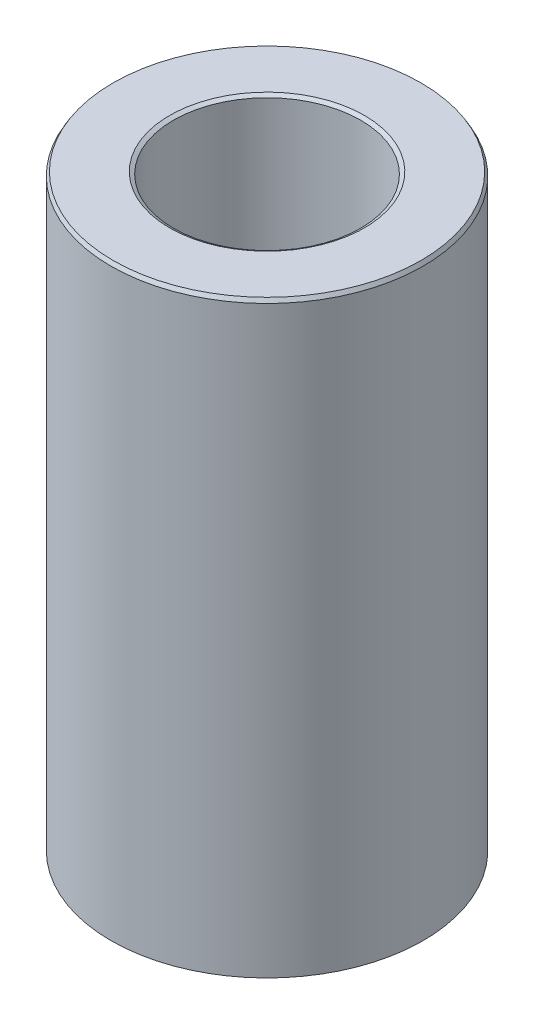
ISO-10303-21;
HEADER;
FILE_DESCRIPTION(('STEP AP214'),'2;1');
FILE_NAME('part.step','',(''),(''),'','','');
FILE_SCHEMA(('AUTOMOTIVE_DESIGN { 1 0 10303 214 1 1 1 1 }'));
ENDSEC;
DATA;
#1=APPLICATION_CONTEXT('core data for automotive mechanical design processes');
#2=APPLICATION_PROTOCOL_DEFINITION('international standard','automotive_design',2000,#1);
#3=PRODUCT_CONTEXT('',#1,'mechanical');
#4=PRODUCT('Part','Part','',(#3));
#5=PRODUCT_RELATED_PRODUCT_CATEGORY('part','',(#4));
#6=PRODUCT_DEFINITION_FORMATION('','',#4);
#7=PRODUCT_DEFINITION_CONTEXT('part definition',#1,'design');
#8=PRODUCT_DEFINITION('design','',#6,#7);
#9=PRODUCT_DEFINITION_SHAPE('','',#8);
#10=(LENGTH_UNIT() NAMED_UNIT(*) SI_UNIT(.MILLI.,.METRE.));
#11=(NAMED_UNIT(*) PLANE_ANGLE_UNIT() SI_UNIT($,.RADIAN.));
#12=(NAMED_UNIT(*) SI_UNIT($,.STERADIAN.) SOLID_ANGLE_UNIT());
#13=UNCERTAINTY_MEASURE_WITH_UNIT(LENGTH_MEASURE(1.E-05),#10,'distance_accuracy_value','');
#14=(GEOMETRIC_REPRESENTATION_CONTEXT(3) GLOBAL_UNCERTAINTY_ASSIGNED_CONTEXT((#13)) GLOBAL_UNIT_ASSIGNED_CONTEXT((#10,
#11,#12)) REPRESENTATION_CONTEXT('',''));
#15=CARTESIAN_POINT('',(0.,0.,0.));
#16=DIRECTION('',(0.,0.,1.));
#17=DIRECTION('',(1.,0.,0.));
#18=AXIS2_PLACEMENT_3D('',#15,#16,#17);
#19=CARTESIAN_POINT('',(0.,179.573982161007,0.));
#20=DIRECTION('',(0.,-1.,0.));
#21=DIRECTION('',(0.,0.,-1.));
#22=AXIS2_PLACEMENT_3D('',#19,#20,#21);
#23=CYLINDRICAL_SURFACE('',#22,47.5);
#24=CARTESIAN_POINT('',(0.,0.668235442624204,0.));
#25=DIRECTION('',(0.,1.,0.));
#26=DIRECTION('',(0.,0.,1.));
#27=AXIS2_PLACEMENT_3D('',#24,#25,#26);
#28=CIRCLE('',#27,47.5);
#29=CARTESIAN_POINT('',(0.,0.668235442624204,47.5));
#30=VERTEX_POINT('',#29);
#31=EDGE_CURVE('E10',#30,#30,#28,.T.);
#32=ORIENTED_EDGE('',*,*,#31,.T.);
#33=EDGE_LOOP('',(#32));
#34=FACE_BOUND('',#33,.T.);
#35=CARTESIAN_POINT('',(0.,178.416564422964,0.));
#36=DIRECTION('',(0.,1.,0.));
#37=DIRECTION('',(0.,0.,1.));
#38=AXIS2_PLACEMENT_3D('',#35,#36,#37);
#39=CIRCLE('',#38,47.5);
#40=CARTESIAN_POINT('',(0.,178.416564422964,47.5));
#41=VERTEX_POINT('',#40);
#42=EDGE_CURVE('E50',#41,#41,#39,.F.);
#43=ORIENTED_EDGE('',*,*,#42,.T.);
#44=EDGE_LOOP('',(#43));
#45=FACE_BOUND('',#44,.T.);
#46=ADVANCED_FACE('F39',(#34,#45),#23,.T.);
#47=CARTESIAN_POINT('',(0.,179.573982161007,0.));
#48=DIRECTION('',(0.,1.,0.));
#49=DIRECTION('',(0.,0.,1.));
#50=AXIS2_PLACEMENT_3D('',#47,#48,#49);
#51=PLANE('',#50);
#52=CARTESIAN_POINT('',(0.,179.573982161007,0.));
#53=DIRECTION('',(0.,1.,0.));
#54=DIRECTION('',(0.,0.,1.));
#55=AXIS2_PLACEMENT_3D('',#52,#53,#54);
#56=CIRCLE('',#55,29.6474263468338);
#57=CARTESIAN_POINT('',(0.,179.573982161007,29.6474263468338));
#58=VERTEX_POINT('',#57);
#59=EDGE_CURVE('E58',#58,#58,#56,.F.);
#60=ORIENTED_EDGE('',*,*,#59,.T.);
#61=EDGE_LOOP('',(#60));
#62=FACE_BOUND('',#61,.T.);
#63=CARTESIAN_POINT('',(0.,179.573982161007,0.));
#64=DIRECTION('',(0.,1.,0.));
#65=DIRECTION('',(0.,0.,1.));
#66=AXIS2_PLACEMENT_3D('',#63,#64,#65);
#67=CIRCLE('',#66,46.8317645573758);
#68=CARTESIAN_POINT('',(0.,179.573982161007,46.8317645573758));
#69=VERTEX_POINT('',#68);
#70=EDGE_CURVE('E61',#69,#69,#67,.T.);
#71=ORIENTED_EDGE('',*,*,#70,.T.);
#72=EDGE_LOOP('',(#71));
#73=FACE_BOUND('',#72,.T.);
#74=ADVANCED_FACE('F88',(#62,#73),#51,.T.);
#75=CARTESIAN_POINT('',(0.,0.,0.));
#76=DIRECTION('',(0.,1.,0.));
#77=DIRECTION('',(0.,0.,1.));
#78=AXIS2_PLACEMENT_3D('',#75,#76,#77);
#79=PLANE('',#78);
#80=CARTESIAN_POINT('',(0.,0.,0.));
#81=DIRECTION('',(0.,1.,0.));
#82=DIRECTION('',(0.,0.,1.));
#83=AXIS2_PLACEMENT_3D('',#80,#81,#82);
#84=CIRCLE('',#83,29.1582440514146);
#85=CARTESIAN_POINT('',(0.,0.,29.1582440514146));
#86=VERTEX_POINT('',#85);
#87=EDGE_CURVE('E51',#86,#86,#84,.T.);
#88=ORIENTED_EDGE('',*,*,#87,.T.);
#89=EDGE_LOOP('',(#88));
#90=FACE_BOUND('',#89,.T.);
#91=CARTESIAN_POINT('',(0.,0.,0.));
#92=DIRECTION('',(0.,1.,0.));
#93=DIRECTION('',(0.,0.,1.));
#94=AXIS2_PLACEMENT_3D('',#91,#92,#93);
#95=CIRCLE('',#94,46.3425822619566);
#96=CARTESIAN_POINT('',(0.,0.,46.3425822619566));
#97=VERTEX_POINT('',#96);
#98=EDGE_CURVE('E54',#97,#97,#95,.F.);
#99=ORIENTED_EDGE('',*,*,#98,.T.);
#100=EDGE_LOOP('',(#99));
#101=FACE_BOUND('',#100,.T.);
#102=ADVANCED_FACE('F83',(#90,#101),#79,.F.);
#103=CARTESIAN_POINT('',(0.,179.573982161007,0.));
#104=DIRECTION('',(0.,-1.,0.));
#105=DIRECTION('',(0.,0.,-1.));
#106=AXIS2_PLACEMENT_3D('',#103,#104,#105);
#107=CYLINDRICAL_SURFACE('',#106,28.4900086087904);
#108=CARTESIAN_POINT('',(0.,178.905746718383,0.));
#109=DIRECTION('',(0.,1.,0.));
#110=DIRECTION('',(0.,0.,1.));
#111=AXIS2_PLACEMENT_3D('',#108,#109,#110);
#112=CIRCLE('',#111,28.4900086087904);
#113=CARTESIAN_POINT('',(0.,178.905746718383,28.4900086087904));
#114=VERTEX_POINT('',#113);
#115=EDGE_CURVE('E67',#114,#114,#112,.T.);
#116=ORIENTED_EDGE('',*,*,#115,.T.);
#117=EDGE_LOOP('',(#116));
#118=FACE_BOUND('',#117,.T.);
#119=CARTESIAN_POINT('',(0.,1.1574177380434,0.));
#120=DIRECTION('',(0.,1.,0.));
#121=DIRECTION('',(0.,0.,1.));
#122=AXIS2_PLACEMENT_3D('',#119,#120,#121);
#123=CIRCLE('',#122,28.4900086087904);
#124=CARTESIAN_POINT('',(0.,1.1574177380434,28.4900086087904));
#125=VERTEX_POINT('',#124);
#126=EDGE_CURVE('E69',#125,#125,#123,.F.);
#127=ORIENTED_EDGE('',*,*,#126,.T.);
#128=EDGE_LOOP('',(#127));
#129=FACE_BOUND('',#128,.T.);
#130=ADVANCED_FACE('F71',(#118,#129),#107,.F.);
#131=CARTESIAN_POINT('',(0.,178.905746718383,0.));
#132=DIRECTION('',(0.,1.,0.));
#133=DIRECTION('',(0.,0.,1.));
#134=AXIS2_PLACEMENT_3D('',#131,#132,#133);
#135=CONICAL_SURFACE('',#134,28.4900086087904,1.0471975511966);
#136=ORIENTED_EDGE('',*,*,#59,.F.);
#137=EDGE_LOOP('',(#136));
#138=FACE_BOUND('',#137,.T.);
#139=ORIENTED_EDGE('',*,*,#115,.F.);
#140=EDGE_LOOP('',(#139));
#141=FACE_BOUND('',#140,.T.);
#142=ADVANCED_FACE('F77',(#138,#141),#135,.F.);
#143=CARTESIAN_POINT('',(0.,0.,0.));
#144=DIRECTION('',(0.,-1.,0.));
#145=DIRECTION('',(0.,0.,-1.));
#146=AXIS2_PLACEMENT_3D('',#143,#144,#145);
#147=CONICAL_SURFACE('',#146,29.1582440514146,0.523598775598299);
#148=ORIENTED_EDGE('',*,*,#126,.F.);
#149=EDGE_LOOP('',(#148));
#150=FACE_BOUND('',#149,.T.);
#151=ORIENTED_EDGE('',*,*,#87,.F.);
#152=EDGE_LOOP('',(#151));
#153=FACE_BOUND('',#152,.T.);
#154=ADVANCED_FACE('F73',(#150,#153),#147,.F.);
#155=CARTESIAN_POINT('',(0.,0.668235442624204,0.));
#156=DIRECTION('',(0.,1.,0.));
#157=DIRECTION('',(0.,0.,1.));
#158=AXIS2_PLACEMENT_3D('',#155,#156,#157);
#159=CONICAL_SURFACE('',#158,47.5,1.04719755119661);
#160=ORIENTED_EDGE('',*,*,#98,.F.);
#161=EDGE_LOOP('',(#160));
#162=FACE_BOUND('',#161,.T.);
#163=ORIENTED_EDGE('',*,*,#31,.F.);
#164=EDGE_LOOP('',(#163));
#165=FACE_BOUND('',#164,.T.);
#166=ADVANCED_FACE('F76',(#162,#165),#159,.T.);
#167=CARTESIAN_POINT('',(0.,179.573982161007,0.));
#168=DIRECTION('',(0.,-1.,0.));
#169=DIRECTION('',(0.,0.,-1.));
#170=AXIS2_PLACEMENT_3D('',#167,#168,#169);
#171=CONICAL_SURFACE('',#170,46.8317645573758,0.523598775598298);
#172=ORIENTED_EDGE('',*,*,#42,.F.);
#173=EDGE_LOOP('',(#172));
#174=FACE_BOUND('',#173,.T.);
#175=ORIENTED_EDGE('',*,*,#70,.F.);
#176=EDGE_LOOP('',(#175));
#177=FACE_BOUND('',#176,.T.);
#178=ADVANCED_FACE('F45',(#174,#177),#171,.T.);
#179=CLOSED_SHELL('',(#46,#74,#102,#130,#142,#154,#166,#178));
#180=MANIFOLD_SOLID_BREP('B2',#179);
#181=ADVANCED_BREP_SHAPE_REPRESENTATION('',(#18,#180),#14);
#182=SHAPE_DEFINITION_REPRESENTATION(#9,#181);
ENDSEC;
END-ISO-10303-21;
